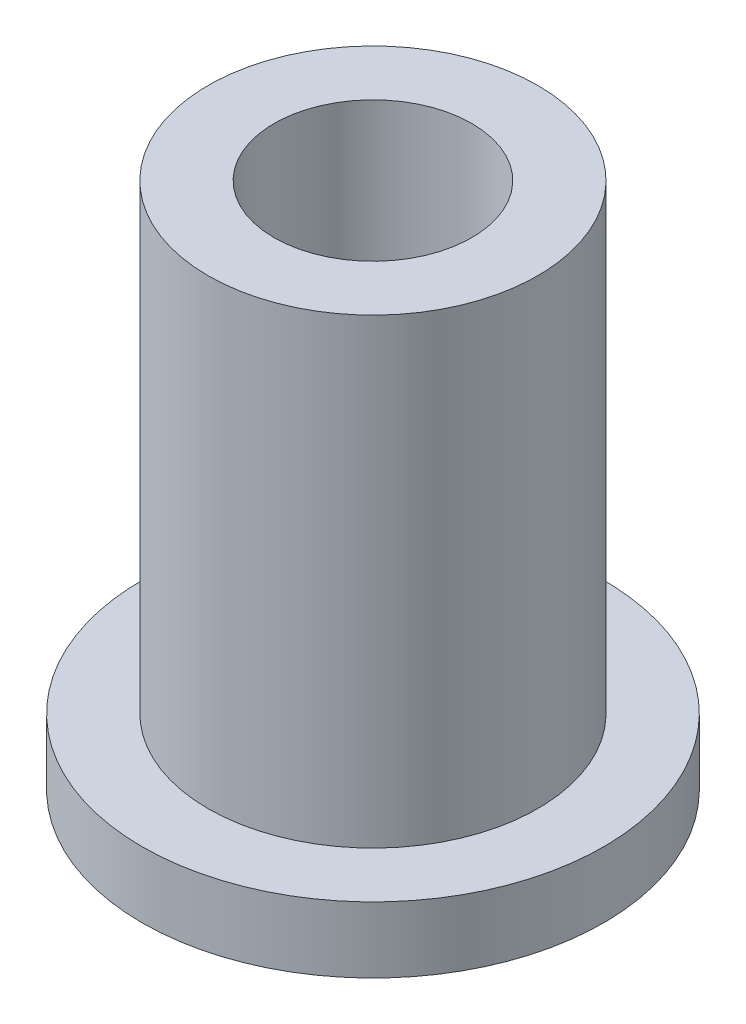
ISO-10303-21;
HEADER;
FILE_DESCRIPTION(('STEP AP214'),'2;1');
FILE_NAME('part.step','',(''),(''),'','','');
FILE_SCHEMA(('AUTOMOTIVE_DESIGN { 1 0 10303 214 1 1 1 1 }'));
ENDSEC;
DATA;
#1=APPLICATION_CONTEXT('core data for automotive mechanical design processes');
#2=APPLICATION_PROTOCOL_DEFINITION('international standard','automotive_design',2000,#1);
#3=PRODUCT_CONTEXT('',#1,'mechanical');
#4=PRODUCT('Part','Part','',(#3));
#5=PRODUCT_RELATED_PRODUCT_CATEGORY('part','',(#4));
#6=PRODUCT_DEFINITION_FORMATION('','',#4);
#7=PRODUCT_DEFINITION_CONTEXT('part definition',#1,'design');
#8=PRODUCT_DEFINITION('design','',#6,#7);
#9=PRODUCT_DEFINITION_SHAPE('','',#8);
#10=(LENGTH_UNIT() NAMED_UNIT(*) SI_UNIT(.MILLI.,.METRE.));
#11=(NAMED_UNIT(*) PLANE_ANGLE_UNIT() SI_UNIT($,.RADIAN.));
#12=(NAMED_UNIT(*) SI_UNIT($,.STERADIAN.) SOLID_ANGLE_UNIT());
#13=UNCERTAINTY_MEASURE_WITH_UNIT(LENGTH_MEASURE(1.E-05),#10,'distance_accuracy_value','');
#14=(GEOMETRIC_REPRESENTATION_CONTEXT(3) GLOBAL_UNCERTAINTY_ASSIGNED_CONTEXT((#13)) GLOBAL_UNIT_ASSIGNED_CONTEXT((#10,
#11,#12)) REPRESENTATION_CONTEXT('',''));
#15=CARTESIAN_POINT('',(0.,0.,0.));
#16=DIRECTION('',(0.,0.,1.));
#17=DIRECTION('',(1.,0.,0.));
#18=AXIS2_PLACEMENT_3D('',#15,#16,#17);
#19=CARTESIAN_POINT('',(0.,12.7,0.));
#20=DIRECTION('',(0.,1.,0.));
#21=DIRECTION('',(0.,0.,1.));
#22=AXIS2_PLACEMENT_3D('',#19,#20,#21);
#23=PLANE('',#22);
#24=CARTESIAN_POINT('',(0.,12.7,0.));
#25=DIRECTION('',(0.,1.,0.));
#26=DIRECTION('',(0.,0.,1.));
#27=AXIS2_PLACEMENT_3D('',#24,#25,#26);
#28=CIRCLE('',#27,3.96875);
#29=CARTESIAN_POINT('',(0.,12.7,3.96875));
#30=VERTEX_POINT('',#29);
#31=EDGE_CURVE('E10',#30,#30,#28,.T.);
#32=ORIENTED_EDGE('',*,*,#31,.T.);
#33=EDGE_LOOP('',(#32));
#34=FACE_BOUND('',#33,.T.);
#35=CARTESIAN_POINT('',(0.,12.7,0.));
#36=DIRECTION('',(0.,1.,0.));
#37=DIRECTION('',(0.,0.,1.));
#38=AXIS2_PLACEMENT_3D('',#35,#36,#37);
#39=CIRCLE('',#38,2.38125);
#40=CARTESIAN_POINT('',(0.,12.7,2.38125));
#41=VERTEX_POINT('',#40);
#42=EDGE_CURVE('E42',#41,#41,#39,.T.);
#43=ORIENTED_EDGE('',*,*,#42,.F.);
#44=EDGE_LOOP('',(#43));
#45=FACE_BOUND('',#44,.T.);
#46=ADVANCED_FACE('F34',(#34,#45),#23,.T.);
#47=CARTESIAN_POINT('',(0.,0.,0.));
#48=DIRECTION('',(0.,1.,0.));
#49=DIRECTION('',(0.,0.,1.));
#50=AXIS2_PLACEMENT_3D('',#47,#48,#49);
#51=PLANE('',#50);
#52=CARTESIAN_POINT('',(0.,0.,0.));
#53=DIRECTION('',(0.,1.,0.));
#54=DIRECTION('',(0.,0.,1.));
#55=AXIS2_PLACEMENT_3D('',#52,#53,#54);
#56=CIRCLE('',#55,2.38125);
#57=CARTESIAN_POINT('',(0.,0.,2.38125));
#58=VERTEX_POINT('',#57);
#59=EDGE_CURVE('E47',#58,#58,#56,.T.);
#60=ORIENTED_EDGE('',*,*,#59,.T.);
#61=EDGE_LOOP('',(#60));
#62=FACE_BOUND('',#61,.T.);
#63=CARTESIAN_POINT('',(0.,0.,0.));
#64=DIRECTION('',(0.,1.,0.));
#65=DIRECTION('',(0.,0.,1.));
#66=AXIS2_PLACEMENT_3D('',#63,#64,#65);
#67=CIRCLE('',#66,5.55625);
#68=CARTESIAN_POINT('',(0.,0.,5.55625));
#69=VERTEX_POINT('',#68);
#70=EDGE_CURVE('E55',#69,#69,#67,.T.);
#71=ORIENTED_EDGE('',*,*,#70,.F.);
#72=EDGE_LOOP('',(#71));
#73=FACE_BOUND('',#72,.T.);
#74=ADVANCED_FACE('F83',(#62,#73),#51,.F.);
#75=CARTESIAN_POINT('',(0.,12.7,0.));
#76=DIRECTION('',(0.,-1.,0.));
#77=DIRECTION('',(0.,0.,-1.));
#78=AXIS2_PLACEMENT_3D('',#75,#76,#77);
#79=CYLINDRICAL_SURFACE('',#78,3.96875);
#80=CARTESIAN_POINT('',(0.,1.5875,0.));
#81=DIRECTION('',(0.,1.,0.));
#82=DIRECTION('',(0.,0.,1.));
#83=AXIS2_PLACEMENT_3D('',#80,#81,#82);
#84=CIRCLE('',#83,3.96875);
#85=CARTESIAN_POINT('',(0.,1.5875,3.96875));
#86=VERTEX_POINT('',#85);
#87=EDGE_CURVE('E59',#86,#86,#84,.T.);
#88=ORIENTED_EDGE('',*,*,#87,.T.);
#89=EDGE_LOOP('',(#88));
#90=FACE_BOUND('',#89,.T.);
#91=ORIENTED_EDGE('',*,*,#31,.F.);
#92=EDGE_LOOP('',(#91));
#93=FACE_BOUND('',#92,.T.);
#94=ADVANCED_FACE('F36',(#90,#93),#79,.T.);
#95=CARTESIAN_POINT('',(0.,12.7,0.));
#96=DIRECTION('',(0.,-1.,0.));
#97=DIRECTION('',(0.,0.,-1.));
#98=AXIS2_PLACEMENT_3D('',#95,#96,#97);
#99=CYLINDRICAL_SURFACE('',#98,2.38125);
#100=ORIENTED_EDGE('',*,*,#42,.T.);
#101=EDGE_LOOP('',(#100));
#102=FACE_BOUND('',#101,.T.);
#103=ORIENTED_EDGE('',*,*,#59,.F.);
#104=EDGE_LOOP('',(#103));
#105=FACE_BOUND('',#104,.T.);
#106=ADVANCED_FACE('F72',(#102,#105),#99,.F.);
#107=CARTESIAN_POINT('',(0.,1.5875,0.));
#108=DIRECTION('',(0.,1.,0.));
#109=DIRECTION('',(0.,0.,1.));
#110=AXIS2_PLACEMENT_3D('',#107,#108,#109);
#111=PLANE('',#110);
#112=CARTESIAN_POINT('',(0.,1.5875,0.));
#113=DIRECTION('',(0.,1.,0.));
#114=DIRECTION('',(0.,0.,1.));
#115=AXIS2_PLACEMENT_3D('',#112,#113,#114);
#116=CIRCLE('',#115,5.55625);
#117=CARTESIAN_POINT('',(0.,1.5875,5.55625));
#118=VERTEX_POINT('',#117);
#119=EDGE_CURVE('E53',#118,#118,#116,.T.);
#120=ORIENTED_EDGE('',*,*,#119,.T.);
#121=EDGE_LOOP('',(#120));
#122=FACE_BOUND('',#121,.T.);
#123=ORIENTED_EDGE('',*,*,#87,.F.);
#124=EDGE_LOOP('',(#123));
#125=FACE_BOUND('',#124,.T.);
#126=ADVANCED_FACE('F69',(#122,#125),#111,.T.);
#127=CARTESIAN_POINT('',(0.,1.5875,0.));
#128=DIRECTION('',(0.,-1.,0.));
#129=DIRECTION('',(0.,0.,-1.));
#130=AXIS2_PLACEMENT_3D('',#127,#128,#129);
#131=CYLINDRICAL_SURFACE('',#130,5.55625);
#132=ORIENTED_EDGE('',*,*,#119,.F.);
#133=EDGE_LOOP('',(#132));
#134=FACE_BOUND('',#133,.T.);
#135=ORIENTED_EDGE('',*,*,#70,.T.);
#136=EDGE_LOOP('',(#135));
#137=FACE_BOUND('',#136,.T.);
#138=ADVANCED_FACE('F71',(#134,#137),#131,.T.);
#139=CLOSED_SHELL('',(#46,#74,#94,#106,#126,#138));
#140=MANIFOLD_SOLID_BREP('B2',#139);
#141=ADVANCED_BREP_SHAPE_REPRESENTATION('',(#18,#140),#14);
#142=SHAPE_DEFINITION_REPRESENTATION(#9,#141);
ENDSEC;
END-ISO-10303-21;
